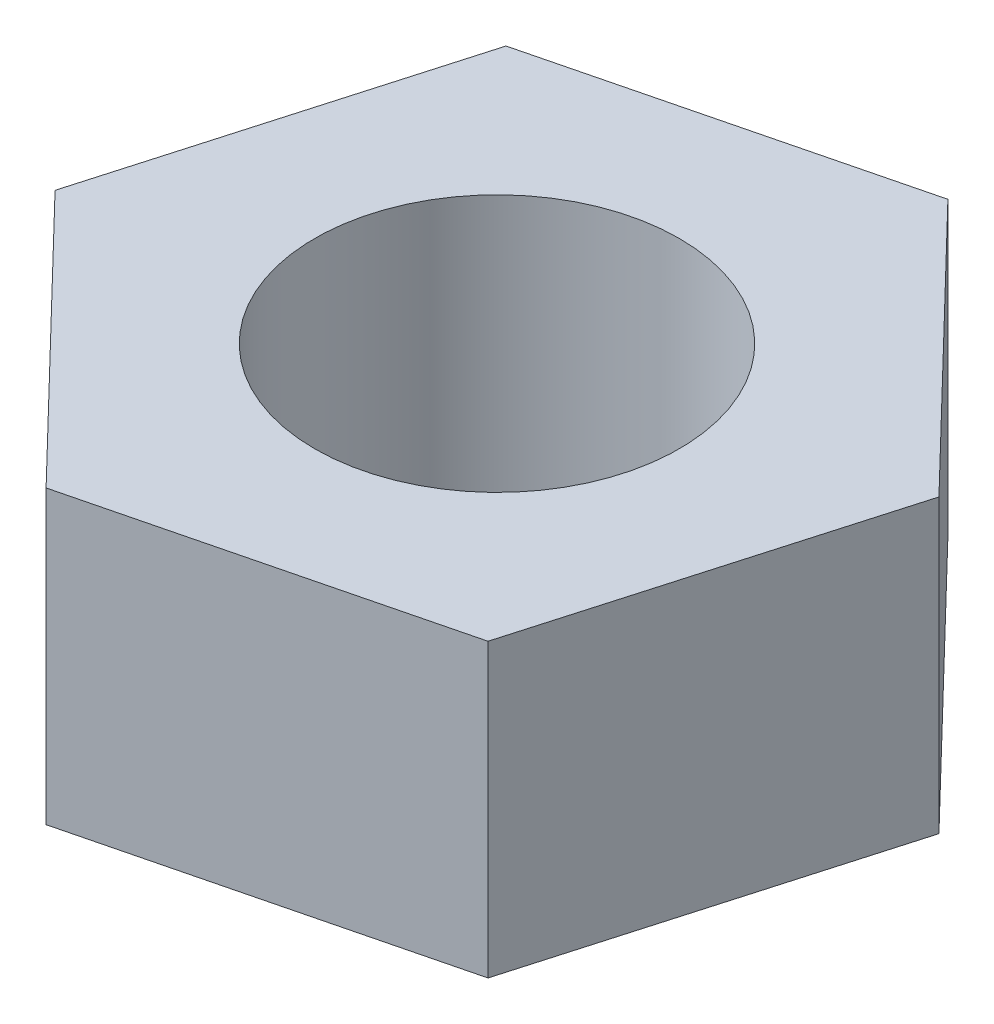
ISO-10303-21;
HEADER;
FILE_DESCRIPTION(('STEP AP214'),'2;1');
FILE_NAME('part.step','',(''),(''),'','','');
FILE_SCHEMA(('AUTOMOTIVE_DESIGN { 1 0 10303 214 1 1 1 1 }'));
ENDSEC;
DATA;
#1=APPLICATION_CONTEXT('core data for automotive mechanical design processes');
#2=APPLICATION_PROTOCOL_DEFINITION('international standard','automotive_design',2000,#1);
#3=PRODUCT_CONTEXT('',#1,'mechanical');
#4=PRODUCT('Part','Part','',(#3));
#5=PRODUCT_RELATED_PRODUCT_CATEGORY('part','',(#4));
#6=PRODUCT_DEFINITION_FORMATION('','',#4);
#7=PRODUCT_DEFINITION_CONTEXT('part definition',#1,'design');
#8=PRODUCT_DEFINITION('design','',#6,#7);
#9=PRODUCT_DEFINITION_SHAPE('','',#8);
#10=(LENGTH_UNIT() NAMED_UNIT(*) SI_UNIT(.MILLI.,.METRE.));
#11=(NAMED_UNIT(*) PLANE_ANGLE_UNIT() SI_UNIT($,.RADIAN.));
#12=(NAMED_UNIT(*) SI_UNIT($,.STERADIAN.) SOLID_ANGLE_UNIT());
#13=UNCERTAINTY_MEASURE_WITH_UNIT(LENGTH_MEASURE(1.E-05),#10,'distance_accuracy_value','');
#14=(GEOMETRIC_REPRESENTATION_CONTEXT(3) GLOBAL_UNCERTAINTY_ASSIGNED_CONTEXT((#13)) GLOBAL_UNIT_ASSIGNED_CONTEXT((#10,
#11,#12)) REPRESENTATION_CONTEXT('',''));
#15=CARTESIAN_POINT('',(0.,0.,0.));
#16=DIRECTION('',(0.,0.,1.));
#17=DIRECTION('',(1.,0.,0.));
#18=AXIS2_PLACEMENT_3D('',#15,#16,#17);
#19=CARTESIAN_POINT('',(0.,5.08,0.));
#20=DIRECTION('',(0.,1.,0.));
#21=DIRECTION('',(0.,0.,1.));
#22=AXIS2_PLACEMENT_3D('',#19,#20,#21);
#23=PLANE('',#22);
#24=DIRECTION('',(0.275595401105184,0.,-0.961273725267508));
#25=VECTOR('',#24,1.);
#26=CARTESIAN_POINT('',(4.41128001104931,5.08,4.567615205347));
#27=LINE('',#26,#25);
#28=CARTESIAN_POINT('',(4.41128001104931,5.08,4.567615205347));
#29=VERTEX_POINT('',#28);
#30=CARTESIAN_POINT('',(6.16131080806723,5.08,-1.5364729501017));
#31=VERTEX_POINT('',#30);
#32=EDGE_CURVE('E150',#29,#31,#27,.T.);
#33=ORIENTED_EDGE('',*,*,#32,.T.);
#34=DIRECTION('',(-0.694689765519574,0.,-0.719309481157005));
#35=VECTOR('',#34,1.);
#36=CARTESIAN_POINT('',(6.16131080806723,5.08,-1.5364729501017));
#37=LINE('',#36,#35);
#38=CARTESIAN_POINT('',(1.75003079701792,5.08,-6.1040881554487));
#39=VERTEX_POINT('',#38);
#40=EDGE_CURVE('E98',#31,#39,#37,.T.);
#41=ORIENTED_EDGE('',*,*,#40,.T.);
#42=DIRECTION('',(-0.970285166624757,0.,0.241964244110503));
#43=VECTOR('',#42,1.);
#44=CARTESIAN_POINT('',(1.75003079701792,5.08,-6.1040881554487));
#45=LINE('',#44,#43);
#46=CARTESIAN_POINT('',(-4.41128001104931,5.08,-4.567615205347));
#47=VERTEX_POINT('',#46);
#48=EDGE_CURVE('E111',#39,#47,#45,.T.);
#49=ORIENTED_EDGE('',*,*,#48,.T.);
#50=DIRECTION('',(-0.275595401105184,0.,0.961273725267508));
#51=VECTOR('',#50,1.);
#52=CARTESIAN_POINT('',(-4.41128001104931,5.08,-4.567615205347));
#53=LINE('',#52,#51);
#54=CARTESIAN_POINT('',(-6.16131080806723,5.08,1.5364729501017));
#55=VERTEX_POINT('',#54);
#56=EDGE_CURVE('E105',#47,#55,#53,.T.);
#57=ORIENTED_EDGE('',*,*,#56,.T.);
#58=DIRECTION('',(0.694689765519574,0.,0.719309481157005));
#59=VECTOR('',#58,1.);
#60=CARTESIAN_POINT('',(-6.16131080806723,5.08,1.5364729501017));
#61=LINE('',#60,#59);
#62=CARTESIAN_POINT('',(-1.75003079701792,5.08,6.1040881554487));
#63=VERTEX_POINT('',#62);
#64=EDGE_CURVE('E109',#55,#63,#61,.T.);
#65=ORIENTED_EDGE('',*,*,#64,.T.);
#66=DIRECTION('',(0.970285166624757,0.,-0.241964244110503));
#67=VECTOR('',#66,1.);
#68=CARTESIAN_POINT('',(-1.75003079701792,5.08,6.1040881554487));
#69=LINE('',#68,#67);
#70=EDGE_CURVE('E61',#63,#29,#69,.T.);
#71=ORIENTED_EDGE('',*,*,#70,.T.);
#72=EDGE_LOOP('',(#33,#41,#49,#57,#65,#71));
#73=FACE_BOUND('',#72,.T.);
#74=CARTESIAN_POINT('',(0.,5.08,0.));
#75=DIRECTION('',(0.,1.,0.));
#76=DIRECTION('',(0.,0.,1.));
#77=AXIS2_PLACEMENT_3D('',#74,#75,#76);
#78=CIRCLE('',#77,3.175);
#79=CARTESIAN_POINT('',(0.,5.08,3.175));
#80=VERTEX_POINT('',#79);
#81=EDGE_CURVE('E138',#80,#80,#78,.T.);
#82=ORIENTED_EDGE('',*,*,#81,.F.);
#83=EDGE_LOOP('',(#82));
#84=FACE_BOUND('',#83,.T.);
#85=ADVANCED_FACE('F43',(#73,#84),#23,.T.);
#86=CARTESIAN_POINT('',(0.,0.,0.));
#87=DIRECTION('',(0.,1.,0.));
#88=DIRECTION('',(0.,0.,1.));
#89=AXIS2_PLACEMENT_3D('',#86,#87,#88);
#90=PLANE('',#89);
#91=DIRECTION('',(0.275595401105184,0.,-0.961273725267508));
#92=VECTOR('',#91,1.);
#93=CARTESIAN_POINT('',(4.41128001104931,0.,4.567615205347));
#94=LINE('',#93,#92);
#95=CARTESIAN_POINT('',(4.41128001104931,0.,4.567615205347));
#96=VERTEX_POINT('',#95);
#97=CARTESIAN_POINT('',(6.16131080806723,0.,-1.5364729501017));
#98=VERTEX_POINT('',#97);
#99=EDGE_CURVE('E133',#96,#98,#94,.T.);
#100=ORIENTED_EDGE('',*,*,#99,.F.);
#101=DIRECTION('',(0.970285166624757,0.,-0.241964244110503));
#102=VECTOR('',#101,1.);
#103=CARTESIAN_POINT('',(-1.75003079701792,0.,6.1040881554487));
#104=LINE('',#103,#102);
#105=CARTESIAN_POINT('',(-1.75003079701792,0.,6.1040881554487));
#106=VERTEX_POINT('',#105);
#107=EDGE_CURVE('E90',#106,#96,#104,.T.);
#108=ORIENTED_EDGE('',*,*,#107,.F.);
#109=DIRECTION('',(0.694689765519574,0.,0.719309481157005));
#110=VECTOR('',#109,1.);
#111=CARTESIAN_POINT('',(-6.16131080806723,0.,1.5364729501017));
#112=LINE('',#111,#110);
#113=CARTESIAN_POINT('',(-6.16131080806723,0.,1.5364729501017));
#114=VERTEX_POINT('',#113);
#115=EDGE_CURVE('E84',#114,#106,#112,.T.);
#116=ORIENTED_EDGE('',*,*,#115,.F.);
#117=DIRECTION('',(-0.275595401105184,0.,0.961273725267508));
#118=VECTOR('',#117,1.);
#119=CARTESIAN_POINT('',(-4.41128001104931,0.,-4.567615205347));
#120=LINE('',#119,#118);
#121=CARTESIAN_POINT('',(-4.41128001104931,0.,-4.567615205347));
#122=VERTEX_POINT('',#121);
#123=EDGE_CURVE('E120',#122,#114,#120,.T.);
#124=ORIENTED_EDGE('',*,*,#123,.F.);
#125=DIRECTION('',(-0.970285166624757,0.,0.241964244110503));
#126=VECTOR('',#125,1.);
#127=CARTESIAN_POINT('',(1.75003079701792,0.,-6.1040881554487));
#128=LINE('',#127,#126);
#129=CARTESIAN_POINT('',(1.75003079701792,0.,-6.1040881554487));
#130=VERTEX_POINT('',#129);
#131=EDGE_CURVE('E141',#130,#122,#128,.T.);
#132=ORIENTED_EDGE('',*,*,#131,.F.);
#133=DIRECTION('',(-0.694689765519574,0.,-0.719309481157005));
#134=VECTOR('',#133,1.);
#135=CARTESIAN_POINT('',(6.16131080806723,0.,-1.5364729501017));
#136=LINE('',#135,#134);
#137=EDGE_CURVE('E137',#98,#130,#136,.T.);
#138=ORIENTED_EDGE('',*,*,#137,.F.);
#139=EDGE_LOOP('',(#100,#108,#116,#124,#132,#138));
#140=FACE_BOUND('',#139,.T.);
#141=CARTESIAN_POINT('',(0.,0.,0.));
#142=DIRECTION('',(0.,1.,0.));
#143=DIRECTION('',(0.,0.,1.));
#144=AXIS2_PLACEMENT_3D('',#141,#142,#143);
#145=CIRCLE('',#144,3.175);
#146=CARTESIAN_POINT('',(0.,0.,3.175));
#147=VERTEX_POINT('',#146);
#148=EDGE_CURVE('E265',#147,#147,#145,.T.);
#149=ORIENTED_EDGE('',*,*,#148,.T.);
#150=EDGE_LOOP('',(#149));
#151=FACE_BOUND('',#150,.T.);
#152=ADVANCED_FACE('F163',(#140,#151),#90,.F.);
#153=CARTESIAN_POINT('',(4.41128001104931,5.08,4.567615205347));
#154=DIRECTION('',(-0.961273725267508,0.,-0.275595401105184));
#155=DIRECTION('',(-0.275595401105184,0.,0.961273725267508));
#156=AXIS2_PLACEMENT_3D('',#153,#154,#155);
#157=PLANE('',#156);
#158=ORIENTED_EDGE('',*,*,#99,.T.);
#159=DIRECTION('',(0.,-1.,0.));
#160=VECTOR('',#159,1.);
#161=CARTESIAN_POINT('',(6.16131080806723,5.08,-1.5364729501017));
#162=LINE('',#161,#160);
#163=EDGE_CURVE('E11',#31,#98,#162,.T.);
#164=ORIENTED_EDGE('',*,*,#163,.F.);
#165=ORIENTED_EDGE('',*,*,#32,.F.);
#166=DIRECTION('',(0.,-1.,0.));
#167=VECTOR('',#166,1.);
#168=CARTESIAN_POINT('',(4.41128001104931,5.08,4.567615205347));
#169=LINE('',#168,#167);
#170=EDGE_CURVE('E129',#29,#96,#169,.T.);
#171=ORIENTED_EDGE('',*,*,#170,.T.);
#172=EDGE_LOOP('',(#158,#164,#165,#171));
#173=FACE_BOUND('',#172,.T.);
#174=ADVANCED_FACE('F45',(#173),#157,.F.);
#175=CARTESIAN_POINT('',(6.16131080806723,5.08,-1.5364729501017));
#176=DIRECTION('',(-0.719309481157005,0.,0.694689765519574));
#177=DIRECTION('',(0.694689765519574,0.,0.719309481157005));
#178=AXIS2_PLACEMENT_3D('',#175,#176,#177);
#179=PLANE('',#178);
#180=ORIENTED_EDGE('',*,*,#137,.T.);
#181=DIRECTION('',(0.,-1.,0.));
#182=VECTOR('',#181,1.);
#183=CARTESIAN_POINT('',(1.75003079701792,5.08,-6.1040881554487));
#184=LINE('',#183,#182);
#185=EDGE_CURVE('E53',#39,#130,#184,.T.);
#186=ORIENTED_EDGE('',*,*,#185,.F.);
#187=ORIENTED_EDGE('',*,*,#40,.F.);
#188=ORIENTED_EDGE('',*,*,#163,.T.);
#189=EDGE_LOOP('',(#180,#186,#187,#188));
#190=FACE_BOUND('',#189,.T.);
#191=ADVANCED_FACE('F188',(#190),#179,.F.);
#192=CARTESIAN_POINT('',(1.75003079701792,5.08,-6.1040881554487));
#193=DIRECTION('',(0.241964244110503,0.,0.970285166624757));
#194=DIRECTION('',(0.970285166624757,0.,-0.241964244110503));
#195=AXIS2_PLACEMENT_3D('',#192,#193,#194);
#196=PLANE('',#195);
#197=ORIENTED_EDGE('',*,*,#131,.T.);
#198=DIRECTION('',(0.,-1.,0.));
#199=VECTOR('',#198,1.);
#200=CARTESIAN_POINT('',(-4.41128001104931,5.08,-4.567615205347));
#201=LINE('',#200,#199);
#202=EDGE_CURVE('E122',#47,#122,#201,.T.);
#203=ORIENTED_EDGE('',*,*,#202,.F.);
#204=ORIENTED_EDGE('',*,*,#48,.F.);
#205=ORIENTED_EDGE('',*,*,#185,.T.);
#206=EDGE_LOOP('',(#197,#203,#204,#205));
#207=FACE_BOUND('',#206,.T.);
#208=ADVANCED_FACE('F160',(#207),#196,.F.);
#209=CARTESIAN_POINT('',(-4.41128001104931,5.08,-4.567615205347));
#210=DIRECTION('',(0.961273725267508,0.,0.275595401105184));
#211=DIRECTION('',(0.275595401105184,0.,-0.961273725267508));
#212=AXIS2_PLACEMENT_3D('',#209,#210,#211);
#213=PLANE('',#212);
#214=ORIENTED_EDGE('',*,*,#123,.T.);
#215=DIRECTION('',(0.,-1.,0.));
#216=VECTOR('',#215,1.);
#217=CARTESIAN_POINT('',(-6.16131080806723,5.08,1.5364729501017));
#218=LINE('',#217,#216);
#219=EDGE_CURVE('E117',#55,#114,#218,.T.);
#220=ORIENTED_EDGE('',*,*,#219,.F.);
#221=ORIENTED_EDGE('',*,*,#56,.F.);
#222=ORIENTED_EDGE('',*,*,#202,.T.);
#223=EDGE_LOOP('',(#214,#220,#221,#222));
#224=FACE_BOUND('',#223,.T.);
#225=ADVANCED_FACE('F118',(#224),#213,.F.);
#226=CARTESIAN_POINT('',(-6.16131080806723,5.08,1.5364729501017));
#227=DIRECTION('',(0.719309481157005,0.,-0.694689765519574));
#228=DIRECTION('',(-0.694689765519574,0.,-0.719309481157005));
#229=AXIS2_PLACEMENT_3D('',#226,#227,#228);
#230=PLANE('',#229);
#231=ORIENTED_EDGE('',*,*,#115,.T.);
#232=DIRECTION('',(0.,-1.,0.));
#233=VECTOR('',#232,1.);
#234=CARTESIAN_POINT('',(-1.75003079701792,5.08,6.1040881554487));
#235=LINE('',#234,#233);
#236=EDGE_CURVE('E123',#63,#106,#235,.T.);
#237=ORIENTED_EDGE('',*,*,#236,.F.);
#238=ORIENTED_EDGE('',*,*,#64,.F.);
#239=ORIENTED_EDGE('',*,*,#219,.T.);
#240=EDGE_LOOP('',(#231,#237,#238,#239));
#241=FACE_BOUND('',#240,.T.);
#242=ADVANCED_FACE('F125',(#241),#230,.F.);
#243=CARTESIAN_POINT('',(-1.75003079701792,5.08,6.1040881554487));
#244=DIRECTION('',(-0.241964244110503,0.,-0.970285166624757));
#245=DIRECTION('',(-0.970285166624757,0.,0.241964244110503));
#246=AXIS2_PLACEMENT_3D('',#243,#244,#245);
#247=PLANE('',#246);
#248=ORIENTED_EDGE('',*,*,#107,.T.);
#249=ORIENTED_EDGE('',*,*,#170,.F.);
#250=ORIENTED_EDGE('',*,*,#70,.F.);
#251=ORIENTED_EDGE('',*,*,#236,.T.);
#252=EDGE_LOOP('',(#248,#249,#250,#251));
#253=FACE_BOUND('',#252,.T.);
#254=ADVANCED_FACE('F168',(#253),#247,.F.);
#255=CARTESIAN_POINT('',(0.,5.08,0.));
#256=DIRECTION('',(0.,-1.,0.));
#257=DIRECTION('',(0.,0.,-1.));
#258=AXIS2_PLACEMENT_3D('',#255,#256,#257);
#259=CYLINDRICAL_SURFACE('',#258,3.175);
#260=ORIENTED_EDGE('',*,*,#81,.T.);
#261=EDGE_LOOP('',(#260));
#262=FACE_BOUND('',#261,.T.);
#263=ORIENTED_EDGE('',*,*,#148,.F.);
#264=EDGE_LOOP('',(#263));
#265=FACE_BOUND('',#264,.T.);
#266=ADVANCED_FACE('F170',(#262,#265),#259,.F.);
#267=CLOSED_SHELL('',(#85,#152,#174,#191,#208,#225,#242,#254,#266));
#268=MANIFOLD_SOLID_BREP('B2',#267);
#269=ADVANCED_BREP_SHAPE_REPRESENTATION('',(#18,#268),#14);
#270=SHAPE_DEFINITION_REPRESENTATION(#9,#269);
ENDSEC;
END-ISO-10303-21;
